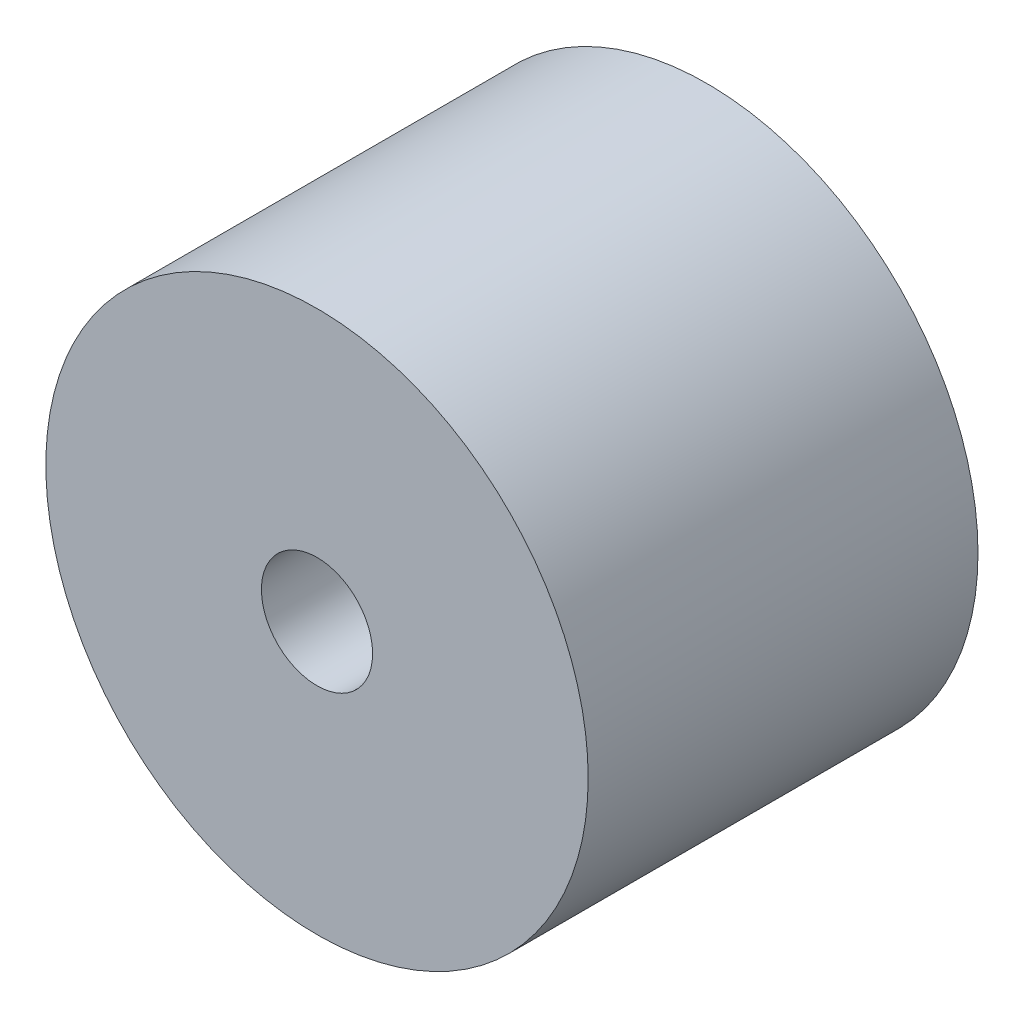
ISO-10303-21;
HEADER;
FILE_DESCRIPTION(('STEP AP214'),'2;1');
FILE_NAME('part.step','',(''),(''),'','','');
FILE_SCHEMA(('AUTOMOTIVE_DESIGN { 1 0 10303 214 1 1 1 1 }'));
ENDSEC;
DATA;
#1=APPLICATION_CONTEXT('core data for automotive mechanical design processes');
#2=APPLICATION_PROTOCOL_DEFINITION('international standard','automotive_design',2000,#1);
#3=PRODUCT_CONTEXT('',#1,'mechanical');
#4=PRODUCT('Part','Part','',(#3));
#5=PRODUCT_RELATED_PRODUCT_CATEGORY('part','',(#4));
#6=PRODUCT_DEFINITION_FORMATION('','',#4);
#7=PRODUCT_DEFINITION_CONTEXT('part definition',#1,'design');
#8=PRODUCT_DEFINITION('design','',#6,#7);
#9=PRODUCT_DEFINITION_SHAPE('','',#8);
#10=(LENGTH_UNIT() NAMED_UNIT(*) SI_UNIT(.MILLI.,.METRE.));
#11=(NAMED_UNIT(*) PLANE_ANGLE_UNIT() SI_UNIT($,.RADIAN.));
#12=(NAMED_UNIT(*) SI_UNIT($,.STERADIAN.) SOLID_ANGLE_UNIT());
#13=UNCERTAINTY_MEASURE_WITH_UNIT(LENGTH_MEASURE(1.E-05),#10,'distance_accuracy_value','');
#14=(GEOMETRIC_REPRESENTATION_CONTEXT(3) GLOBAL_UNCERTAINTY_ASSIGNED_CONTEXT((#13)) GLOBAL_UNIT_ASSIGNED_CONTEXT((#10,
#11,#12)) REPRESENTATION_CONTEXT('',''));
#15=CARTESIAN_POINT('',(0.,0.,0.));
#16=DIRECTION('',(0.,0.,1.));
#17=DIRECTION('',(1.,0.,0.));
#18=AXIS2_PLACEMENT_3D('',#15,#16,#17);
#19=CARTESIAN_POINT('',(0.,0.,28.75));
#20=DIRECTION('',(0.,0.,-1.));
#21=DIRECTION('',(-1.,0.,0.));
#22=AXIS2_PLACEMENT_3D('',#19,#20,#21);
#23=CYLINDRICAL_SURFACE('',#22,20.);
#24=CARTESIAN_POINT('',(0.,0.,28.75));
#25=DIRECTION('',(0.,0.,1.));
#26=DIRECTION('',(1.,0.,0.));
#27=AXIS2_PLACEMENT_3D('',#24,#25,#26);
#28=CIRCLE('',#27,20.);
#29=CARTESIAN_POINT('',(20.,0.,28.75));
#30=VERTEX_POINT('',#29);
#31=EDGE_CURVE('E10',#30,#30,#28,.T.);
#32=ORIENTED_EDGE('',*,*,#31,.F.);
#33=EDGE_LOOP('',(#32));
#34=FACE_BOUND('',#33,.T.);
#35=CARTESIAN_POINT('',(0.,0.,0.));
#36=DIRECTION('',(0.,0.,1.));
#37=DIRECTION('',(1.,0.,0.));
#38=AXIS2_PLACEMENT_3D('',#35,#36,#37);
#39=CIRCLE('',#38,20.);
#40=CARTESIAN_POINT('',(20.,0.,0.));
#41=VERTEX_POINT('',#40);
#42=EDGE_CURVE('E33',#41,#41,#39,.T.);
#43=ORIENTED_EDGE('',*,*,#42,.T.);
#44=EDGE_LOOP('',(#43));
#45=FACE_BOUND('',#44,.T.);
#46=ADVANCED_FACE('F30',(#34,#45),#23,.T.);
#47=CARTESIAN_POINT('',(0.,0.,28.75));
#48=DIRECTION('',(0.,0.,1.));
#49=DIRECTION('',(1.,0.,0.));
#50=AXIS2_PLACEMENT_3D('',#47,#48,#49);
#51=PLANE('',#50);
#52=CARTESIAN_POINT('',(0.,0.,28.75));
#53=DIRECTION('',(0.,0.,1.));
#54=DIRECTION('',(1.,0.,0.));
#55=AXIS2_PLACEMENT_3D('',#52,#53,#54);
#56=CIRCLE('',#55,4.1);
#57=CARTESIAN_POINT('',(4.1,0.,28.75));
#58=VERTEX_POINT('',#57);
#59=EDGE_CURVE('E42',#58,#58,#56,.T.);
#60=ORIENTED_EDGE('',*,*,#59,.F.);
#61=EDGE_LOOP('',(#60));
#62=FACE_BOUND('',#61,.T.);
#63=ORIENTED_EDGE('',*,*,#31,.T.);
#64=EDGE_LOOP('',(#63));
#65=FACE_BOUND('',#64,.T.);
#66=ADVANCED_FACE('F57',(#62,#65),#51,.T.);
#67=CARTESIAN_POINT('',(0.,0.,0.));
#68=DIRECTION('',(0.,0.,1.));
#69=DIRECTION('',(1.,0.,0.));
#70=AXIS2_PLACEMENT_3D('',#67,#68,#69);
#71=PLANE('',#70);
#72=CARTESIAN_POINT('',(0.,0.,0.));
#73=DIRECTION('',(0.,0.,1.));
#74=DIRECTION('',(1.,0.,0.));
#75=AXIS2_PLACEMENT_3D('',#72,#73,#74);
#76=CIRCLE('',#75,4.1);
#77=CARTESIAN_POINT('',(4.1,0.,0.));
#78=VERTEX_POINT('',#77);
#79=EDGE_CURVE('E40',#78,#78,#76,.T.);
#80=ORIENTED_EDGE('',*,*,#79,.T.);
#81=EDGE_LOOP('',(#80));
#82=FACE_BOUND('',#81,.T.);
#83=ORIENTED_EDGE('',*,*,#42,.F.);
#84=EDGE_LOOP('',(#83));
#85=FACE_BOUND('',#84,.T.);
#86=ADVANCED_FACE('F48',(#82,#85),#71,.F.);
#87=CARTESIAN_POINT('',(0.,0.,0.));
#88=DIRECTION('',(0.,0.,1.));
#89=DIRECTION('',(1.,0.,0.));
#90=AXIS2_PLACEMENT_3D('',#87,#88,#89);
#91=CYLINDRICAL_SURFACE('',#90,4.1);
#92=ORIENTED_EDGE('',*,*,#79,.F.);
#93=EDGE_LOOP('',(#92));
#94=FACE_BOUND('',#93,.T.);
#95=ORIENTED_EDGE('',*,*,#59,.T.);
#96=EDGE_LOOP('',(#95));
#97=FACE_BOUND('',#96,.T.);
#98=ADVANCED_FACE('F51',(#94,#97),#91,.F.);
#99=CLOSED_SHELL('',(#46,#66,#86,#98));
#100=MANIFOLD_SOLID_BREP('B2',#99);
#101=ADVANCED_BREP_SHAPE_REPRESENTATION('',(#18,#100),#14);
#102=SHAPE_DEFINITION_REPRESENTATION(#9,#101);
ENDSEC;
END-ISO-10303-21;
